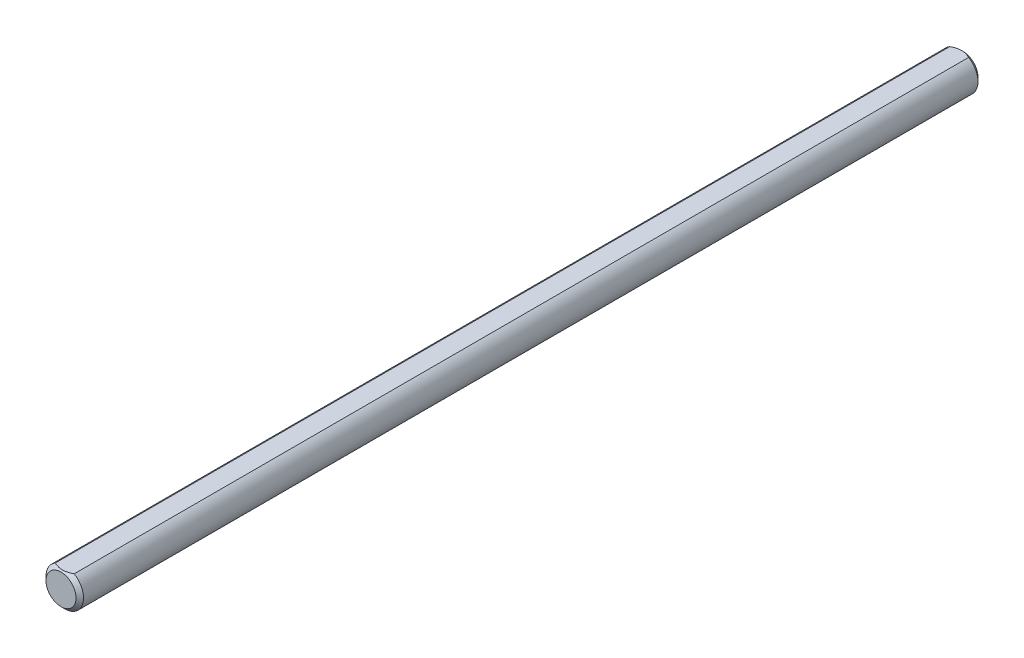
ISO-10303-21;
HEADER;
FILE_DESCRIPTION(('STEP AP214'),'2;1');
FILE_NAME('part.step','',(''),(''),'','','');
FILE_SCHEMA(('AUTOMOTIVE_DESIGN { 1 0 10303 214 1 1 1 1 }'));
ENDSEC;
DATA;
#1=APPLICATION_CONTEXT('core data for automotive mechanical design processes');
#2=APPLICATION_PROTOCOL_DEFINITION('international standard','automotive_design',2000,#1);
#3=PRODUCT_CONTEXT('',#1,'mechanical');
#4=PRODUCT('Part','Part','',(#3));
#5=PRODUCT_RELATED_PRODUCT_CATEGORY('part','',(#4));
#6=PRODUCT_DEFINITION_FORMATION('','',#4);
#7=PRODUCT_DEFINITION_CONTEXT('part definition',#1,'design');
#8=PRODUCT_DEFINITION('design','',#6,#7);
#9=PRODUCT_DEFINITION_SHAPE('','',#8);
#10=(LENGTH_UNIT() NAMED_UNIT(*) SI_UNIT(.MILLI.,.METRE.));
#11=(NAMED_UNIT(*) PLANE_ANGLE_UNIT() SI_UNIT($,.RADIAN.));
#12=(NAMED_UNIT(*) SI_UNIT($,.STERADIAN.) SOLID_ANGLE_UNIT());
#13=UNCERTAINTY_MEASURE_WITH_UNIT(LENGTH_MEASURE(1.E-05),#10,'distance_accuracy_value','');
#14=(GEOMETRIC_REPRESENTATION_CONTEXT(3) GLOBAL_UNCERTAINTY_ASSIGNED_CONTEXT((#13)) GLOBAL_UNIT_ASSIGNED_CONTEXT((#10,
#11,#12)) REPRESENTATION_CONTEXT('',''));
#15=CARTESIAN_POINT('',(0.,0.,0.));
#16=DIRECTION('',(0.,0.,1.));
#17=DIRECTION('',(1.,0.,0.));
#18=AXIS2_PLACEMENT_3D('',#15,#16,#17);
#19=CARTESIAN_POINT('',(0.,0.,76.2));
#20=DIRECTION('',(0.,0.,-1.));
#21=DIRECTION('',(-1.,0.,0.));
#22=AXIS2_PLACEMENT_3D('',#19,#20,#21);
#23=CYLINDRICAL_SURFACE('',#22,3.175);
#24=CARTESIAN_POINT('',(0.,0.,75.5650000000001));
#25=DIRECTION('',(0.,0.,1.));
#26=DIRECTION('',(1.,0.,0.));
#27=AXIS2_PLACEMENT_3D('',#24,#25,#26);
#28=CIRCLE('',#27,3.175);
#29=CARTESIAN_POINT('',(1.5875,2.74963065701559,75.5650000000001));
#30=VERTEX_POINT('',#29);
#31=CARTESIAN_POINT('',(-1.5875,2.74963065701559,75.5650000000001));
#32=VERTEX_POINT('',#31);
#33=EDGE_CURVE('E73',#30,#32,#28,.F.);
#34=ORIENTED_EDGE('',*,*,#33,.T.);
#35=DIRECTION('',(0.,0.,1.));
#36=VECTOR('',#35,1.);
#37=CARTESIAN_POINT('',(-1.5875,2.74963065701559,-76.2));
#38=LINE('',#37,#36);
#39=CARTESIAN_POINT('',(-1.5875,2.74963065701559,-75.5649999999999));
#40=VERTEX_POINT('',#39);
#41=EDGE_CURVE('E51',#40,#32,#38,.T.);
#42=ORIENTED_EDGE('',*,*,#41,.F.);
#43=CARTESIAN_POINT('',(0.,0.,-75.5649999999999));
#44=DIRECTION('',(0.,0.,1.));
#45=DIRECTION('',(1.,0.,0.));
#46=AXIS2_PLACEMENT_3D('',#43,#44,#45);
#47=CIRCLE('',#46,3.175);
#48=CARTESIAN_POINT('',(1.5875,2.74963065701559,-75.5649999999999));
#49=VERTEX_POINT('',#48);
#50=EDGE_CURVE('E72',#40,#49,#47,.T.);
#51=ORIENTED_EDGE('',*,*,#50,.T.);
#52=DIRECTION('',(0.,0.,1.));
#53=VECTOR('',#52,1.);
#54=CARTESIAN_POINT('',(1.5875,2.74963065701559,-76.2));
#55=LINE('',#54,#53);
#56=EDGE_CURVE('E61',#49,#30,#55,.T.);
#57=ORIENTED_EDGE('',*,*,#56,.T.);
#58=EDGE_LOOP('',(#34,#42,#51,#57));
#59=FACE_BOUND('',#58,.T.);
#60=ADVANCED_FACE('F32',(#59),#23,.T.);
#61=CARTESIAN_POINT('',(0.,0.,76.2));
#62=DIRECTION('',(0.,0.,1.));
#63=DIRECTION('',(1.,0.,0.));
#64=AXIS2_PLACEMENT_3D('',#61,#62,#63);
#65=PLANE('',#64);
#66=CARTESIAN_POINT('',(0.,0.,76.2));
#67=DIRECTION('',(0.,0.,1.));
#68=DIRECTION('',(1.,0.,0.));
#69=AXIS2_PLACEMENT_3D('',#66,#67,#68);
#70=CIRCLE('',#69,2.54000000000008);
#71=CARTESIAN_POINT('',(2.54000000000008,0.,76.2));
#72=VERTEX_POINT('',#71);
#73=EDGE_CURVE('E45',#72,#72,#70,.T.);
#74=ORIENTED_EDGE('',*,*,#73,.T.);
#75=EDGE_LOOP('',(#74));
#76=FACE_BOUND('',#75,.T.);
#77=ADVANCED_FACE('F83',(#76),#65,.T.);
#78=CARTESIAN_POINT('',(0.,0.,-76.2));
#79=DIRECTION('',(0.,0.,1.));
#80=DIRECTION('',(1.,0.,0.));
#81=AXIS2_PLACEMENT_3D('',#78,#79,#80);
#82=PLANE('',#81);
#83=CARTESIAN_POINT('',(0.,0.,-76.2));
#84=DIRECTION('',(0.,0.,1.));
#85=DIRECTION('',(1.,0.,0.));
#86=AXIS2_PLACEMENT_3D('',#83,#84,#85);
#87=CIRCLE('',#86,2.53999999999988);
#88=CARTESIAN_POINT('',(2.53999999999988,0.,-76.2));
#89=VERTEX_POINT('',#88);
#90=EDGE_CURVE('E75',#89,#89,#87,.F.);
#91=ORIENTED_EDGE('',*,*,#90,.T.);
#92=EDGE_LOOP('',(#91));
#93=FACE_BOUND('',#92,.T.);
#94=ADVANCED_FACE('F91',(#93),#82,.F.);
#95=CARTESIAN_POINT('',(0.,0.,-75.5649999999999));
#96=DIRECTION('',(0.,0.,1.));
#97=DIRECTION('',(1.,0.,0.));
#98=AXIS2_PLACEMENT_3D('',#95,#96,#97);
#99=CONICAL_SURFACE('',#98,3.175,0.785398163397441);
#100=CARTESIAN_POINT('',(-3.22896135223723,2.74963065701559,-74.4989317189837));
#101=CARTESIAN_POINT('',(-3.15061649550098,2.74963065701559,-74.5585665245459));
#102=CARTESIAN_POINT('',(-3.07184009651257,2.74963065701559,-74.6176434820249));
#103=CARTESIAN_POINT('',(-2.91325130568812,2.74963065701559,-74.7344297176182));
#104=CARTESIAN_POINT('',(-2.83343866506288,2.74963065701559,-74.7921386575257));
#105=CARTESIAN_POINT('',(-2.6720206285274,2.74963065701559,-74.906347547805));
#106=CARTESIAN_POINT('',(-2.59040613970423,2.74963065701559,-74.9628346895371));
#107=CARTESIAN_POINT('',(-2.42580311622158,2.74963065701559,-75.0737635143343));
#108=CARTESIAN_POINT('',(-2.3428146780933,2.74963065701559,-75.1282053402284));
#109=CARTESIAN_POINT('',(-2.17021447787224,2.74963065701559,-75.2377738711655));
#110=CARTESIAN_POINT('',(-2.08050398524188,2.74963065701559,-75.2927458353401));
#111=CARTESIAN_POINT('',(-1.89900904678686,2.74963065701559,-75.3991469931977));
#112=CARTESIAN_POINT('',(-1.80722487525631,2.74963065701559,-75.4505766518348));
#113=CARTESIAN_POINT('',(-1.62153760368926,2.74963065701559,-75.5488148050513));
#114=CARTESIAN_POINT('',(-1.5276414092249,2.74963065701559,-75.5956362501766));
#115=CARTESIAN_POINT('',(-1.33724706572097,2.74963065701559,-75.6836008153406));
#116=CARTESIAN_POINT('',(-1.24075014112705,2.74963065701559,-75.7247465535941));
#117=CARTESIAN_POINT('',(-1.05364742760746,2.74963065701559,-75.7965564372304));
#118=CARTESIAN_POINT('',(-0.96327642558862,2.74963065701559,-75.8278260439731));
#119=CARTESIAN_POINT('',(-0.780303735161088,2.74963065701559,-75.8831231873503));
#120=CARTESIAN_POINT('',(-0.687701898779448,2.74963065701559,-75.9071502421445));
#121=CARTESIAN_POINT('',(-0.502391431282842,2.74963065701559,-75.946288290841));
#122=CARTESIAN_POINT('',(-0.409716445146749,2.74963065701559,-75.9615559547488));
#123=CARTESIAN_POINT('',(-0.223306330685266,2.74963065701559,-75.9828688420293));
#124=CARTESIAN_POINT('',(-0.12957140343737,2.74963065701559,-75.988915786014));
#125=CARTESIAN_POINT('',(0.0543357559016697,2.74963065701559,-75.9913094852483));
#126=CARTESIAN_POINT('',(0.144503242552356,2.74963065701559,-75.9880280862277));
#127=CARTESIAN_POINT('',(0.324095543573396,2.74963065701559,-75.9727817719637));
#128=CARTESIAN_POINT('',(0.413520286896849,2.74963065701559,-75.9608160354813));
#129=CARTESIAN_POINT('',(0.592496066024053,2.74963065701559,-75.928661523536));
#130=CARTESIAN_POINT('',(0.682021177378998,2.74963065701559,-75.9083305801751));
#131=CARTESIAN_POINT('',(0.859103373963801,2.74963065701559,-75.8605451979539));
#132=CARTESIAN_POINT('',(0.946660601088758,2.74963065701559,-75.8330912745011));
#133=CARTESIAN_POINT('',(1.21954622680459,2.74963065701559,-75.7371294821896));
#134=CARTESIAN_POINT('',(1.40108594012661,2.74963065701559,-75.6578094527362));
#135=CARTESIAN_POINT('',(1.66675889489853,2.74963065701559,-75.5255539852256));
#136=CARTESIAN_POINT('',(1.7543748838501,2.74963065701559,-75.4791526611237));
#137=CARTESIAN_POINT('',(1.92761951465594,2.74963065701559,-75.3827692377676));
#138=CARTESIAN_POINT('',(2.0132485070545,2.74963065701559,-75.3327877765755));
#139=CARTESIAN_POINT('',(2.17855184285729,2.74963065701559,-75.232513843306));
#140=CARTESIAN_POINT('',(2.25831097248794,2.74963065701559,-75.1823595590395));
#141=CARTESIAN_POINT('',(2.4164611863999,2.74963065701559,-75.0799282177625));
#142=CARTESIAN_POINT('',(2.49485216688171,2.74963065701559,-75.0276510006804));
#143=CARTESIAN_POINT('',(2.64980987258622,2.74963065701559,-74.9217831250553));
#144=CARTESIAN_POINT('',(2.72638621983951,2.74963065701559,-74.8682064917738));
#145=CARTESIAN_POINT('',(2.87849044969159,2.74963065701559,-74.7596270900168));
#146=CARTESIAN_POINT('',(2.95401861519254,2.74963065701559,-74.704624718309));
#147=CARTESIAN_POINT('',(3.02910770969615,2.74963065701559,-74.6490389555825));
#148=B_SPLINE_CURVE_WITH_KNOTS('',3,(#100,#101,#102,#103,#104,#105,#106,#107,#108,#109,#110,
#111,#112,#113,#114,#115,#116,#117,#118,#119,#120,#121,#122,#123,#124,#125,#126,#127,#128,#129,
#130,#131,#132,#133,#134,#135,#136,#137,#138,#139,#140,#141,#142,#143,#144,#145,#146,#147),
.UNSPECIFIED.,.F.,.F.,(4,2,2,2,2,2,2,2,2,2,2,2,2,2,2,2,2,2,2,2,2,2,2,4),(0.,0.295383449271204,
0.590839178498781,0.888580871622932,1.18630173399067,1.50187785569753,1.81741247644343,
2.13203338294816,2.44650866534169,2.73314264689628,3.01979569373825,3.30114758261616,
3.58244696402017,3.85269226293483,4.12296312107177,4.39803055604388,4.6730780931186,
5.26557071241297,5.56297998480365,5.8603363833345,6.1429552359086,6.42559543796906,
6.70595195130099,6.98623126477245),.UNSPECIFIED.);
#149=EDGE_CURVE('E56',#49,#40,#148,.F.);
#150=ORIENTED_EDGE('',*,*,#149,.F.);
#151=ORIENTED_EDGE('',*,*,#50,.F.);
#152=EDGE_LOOP('',(#150,#151));
#153=FACE_BOUND('',#152,.T.);
#154=ORIENTED_EDGE('',*,*,#90,.F.);
#155=EDGE_LOOP('',(#154));
#156=FACE_BOUND('',#155,.T.);
#157=ADVANCED_FACE('F70',(#153,#156),#99,.T.);
#158=CARTESIAN_POINT('',(0.,0.,76.2));
#159=DIRECTION('',(0.,0.,-1.));
#160=DIRECTION('',(-1.,0.,0.));
#161=AXIS2_PLACEMENT_3D('',#158,#159,#160);
#162=CONICAL_SURFACE('',#161,2.54000000000008,0.785398163397452);
#163=CARTESIAN_POINT('',(-3.22896135223734,2.74963065701559,74.4989317189838));
#164=CARTESIAN_POINT('',(-3.15061649550109,2.74963065701559,74.5585665245461));
#165=CARTESIAN_POINT('',(-3.07184009651267,2.74963065701559,74.6176434820251));
#166=CARTESIAN_POINT('',(-2.91325130568822,2.74963065701559,74.7344297176184));
#167=CARTESIAN_POINT('',(-2.83343866506298,2.74963065701559,74.7921386575259));
#168=CARTESIAN_POINT('',(-2.6720206285275,2.74963065701559,74.9063475478052));
#169=CARTESIAN_POINT('',(-2.59040613970432,2.74963065701559,74.9628346895372));
#170=CARTESIAN_POINT('',(-2.42580311622166,2.74963065701559,75.0737635143345));
#171=CARTESIAN_POINT('',(-2.34281467809337,2.74963065701559,75.1282053402286));
#172=CARTESIAN_POINT('',(-2.17021447787231,2.74963065701559,75.2377738711657));
#173=CARTESIAN_POINT('',(-2.08050398524195,2.74963065701559,75.2927458353403));
#174=CARTESIAN_POINT('',(-1.89900904678693,2.74963065701559,75.3991469931979));
#175=CARTESIAN_POINT('',(-1.80722487525637,2.74963065701559,75.450576651835));
#176=CARTESIAN_POINT('',(-1.62153760368931,2.74963065701559,75.5488148050515));
#177=CARTESIAN_POINT('',(-1.52764140922495,2.74963065701559,75.5956362501768));
#178=CARTESIAN_POINT('',(-1.33724706572101,2.74963065701559,75.6836008153408));
#179=CARTESIAN_POINT('',(-1.24075014112709,2.74963065701559,75.7247465535943));
#180=CARTESIAN_POINT('',(-1.0536474276075,2.74963065701559,75.7965564372306));
#181=CARTESIAN_POINT('',(-0.963276425588651,2.74963065701559,75.8278260439733));
#182=CARTESIAN_POINT('',(-0.780303735161114,2.74963065701559,75.8831231873505));
#183=CARTESIAN_POINT('',(-0.68770189877947,2.74963065701559,75.9071502421447));
#184=CARTESIAN_POINT('',(-0.502391431282856,2.74963065701559,75.9462882908412));
#185=CARTESIAN_POINT('',(-0.409716445146758,2.74963065701559,75.961555954749));
#186=CARTESIAN_POINT('',(-0.223306330685266,2.74963065701559,75.9828688420295));
#187=CARTESIAN_POINT('',(-0.129571403437367,2.74963065701559,75.9889157860142));
#188=CARTESIAN_POINT('',(0.0543357559016806,2.74963065701559,75.9913094852486));
#189=CARTESIAN_POINT('',(0.144503242552371,2.74963065701559,75.9880280862279));
#190=CARTESIAN_POINT('',(0.324095543573417,2.74963065701559,75.9727817719639));
#191=CARTESIAN_POINT('',(0.413520286896872,2.74963065701559,75.9608160354815));
#192=CARTESIAN_POINT('',(0.592496066024079,2.74963065701559,75.9286615235362));
#193=CARTESIAN_POINT('',(0.682021177379025,2.74963065701559,75.9083305801753));
#194=CARTESIAN_POINT('',(0.859103373963831,2.74963065701559,75.860545197954));
#195=CARTESIAN_POINT('',(0.946660601088792,2.74963065701559,75.8330912745013));
#196=CARTESIAN_POINT('',(1.21954622680464,2.74963065701559,75.7371294821898));
#197=CARTESIAN_POINT('',(1.40108594012667,2.74963065701559,75.6578094527364));
#198=CARTESIAN_POINT('',(1.66675889489862,2.74963065701559,75.5255539852258));
#199=CARTESIAN_POINT('',(1.7543748838502,2.74963065701559,75.4791526611239));
#200=CARTESIAN_POINT('',(1.92761951465604,2.74963065701559,75.3827692377678));
#201=CARTESIAN_POINT('',(2.0132485070546,2.74963065701559,75.3327877765757));
#202=CARTESIAN_POINT('',(2.1785518428574,2.74963065701559,75.2325138433062));
#203=CARTESIAN_POINT('',(2.25831097248805,2.74963065701559,75.1823595590397));
#204=CARTESIAN_POINT('',(2.41646118640002,2.74963065701559,75.0799282177626));
#205=CARTESIAN_POINT('',(2.49485216688183,2.74963065701559,75.0276510006806));
#206=CARTESIAN_POINT('',(2.64980987258634,2.74963065701559,74.9217831250555));
#207=CARTESIAN_POINT('',(2.72638621983964,2.74963065701559,74.8682064917739));
#208=CARTESIAN_POINT('',(2.87849044969172,2.74963065701559,74.759627090017));
#209=CARTESIAN_POINT('',(2.95401861519267,2.74963065701559,74.7046247183091));
#210=CARTESIAN_POINT('',(3.02910770969629,2.74963065701559,74.6490389555826));
#211=B_SPLINE_CURVE_WITH_KNOTS('',3,(#163,#164,#165,#166,#167,#168,#169,#170,#171,#172,#173,
#174,#175,#176,#177,#178,#179,#180,#181,#182,#183,#184,#185,#186,#187,#188,#189,#190,#191,#192,
#193,#194,#195,#196,#197,#198,#199,#200,#201,#202,#203,#204,#205,#206,#207,#208,#209,#210),
.UNSPECIFIED.,.F.,.F.,(4,2,2,2,2,2,2,2,2,2,2,2,2,2,2,2,2,2,2,2,2,2,2,4),(0.,0.295383449271204,
0.590839178498794,0.888580871622965,1.18630173399071,1.50187785569758,1.81741247644349,
2.13203338294824,2.44650866534178,2.73314264689638,3.01979569373836,3.30114758261628,
3.5824469640203,3.85269226293498,4.12296312107192,4.39803055604403,4.67307809311876,
5.26557071241318,5.56297998480388,5.86033638333474,6.14295523590886,6.42559543796932,
6.70595195130127,6.98623126477273),.UNSPECIFIED.);
#212=EDGE_CURVE('E11',#32,#30,#211,.T.);
#213=ORIENTED_EDGE('',*,*,#212,.F.);
#214=ORIENTED_EDGE('',*,*,#33,.F.);
#215=EDGE_LOOP('',(#213,#214));
#216=FACE_BOUND('',#215,.T.);
#217=ORIENTED_EDGE('',*,*,#73,.F.);
#218=EDGE_LOOP('',(#217));
#219=FACE_BOUND('',#218,.T.);
#220=ADVANCED_FACE('F34',(#216,#219),#162,.T.);
#221=CARTESIAN_POINT('',(-1.5875,2.74963065701559,-76.2));
#222=DIRECTION('',(0.,-1.,0.));
#223=DIRECTION('',(0.,0.,-1.));
#224=AXIS2_PLACEMENT_3D('',#221,#222,#223);
#225=PLANE('',#224);
#226=ORIENTED_EDGE('',*,*,#149,.T.);
#227=ORIENTED_EDGE('',*,*,#41,.T.);
#228=ORIENTED_EDGE('',*,*,#212,.T.);
#229=ORIENTED_EDGE('',*,*,#56,.F.);
#230=EDGE_LOOP('',(#226,#227,#228,#229));
#231=FACE_BOUND('',#230,.T.);
#232=ADVANCED_FACE('F62',(#231),#225,.F.);
#233=CLOSED_SHELL('',(#60,#77,#94,#157,#220,#232));
#234=MANIFOLD_SOLID_BREP('B2',#233);
#235=ADVANCED_BREP_SHAPE_REPRESENTATION('',(#18,#234),#14);
#236=SHAPE_DEFINITION_REPRESENTATION(#9,#235);
ENDSEC;
END-ISO-10303-21;
